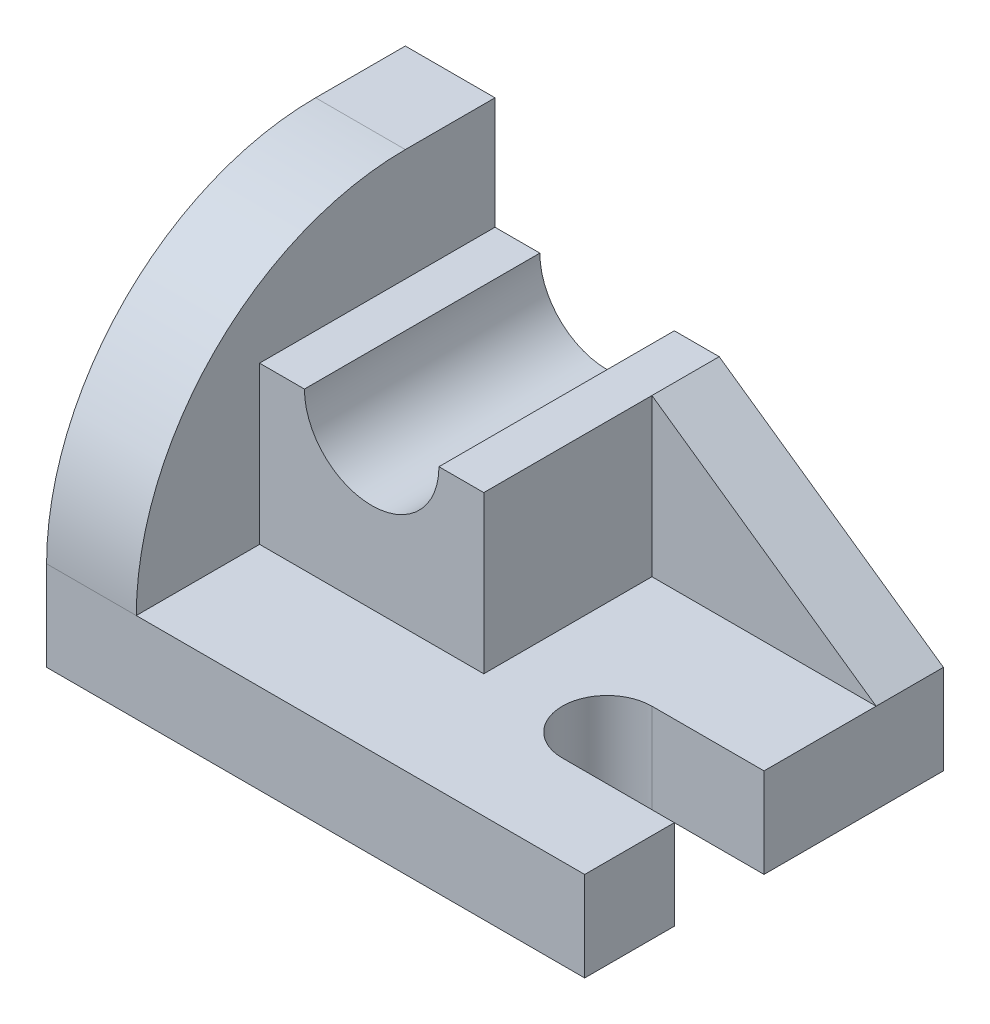
ISO-10303-21;
HEADER;
FILE_DESCRIPTION(('STEP AP214'),'2;1');
FILE_NAME('part.step','',(''),(''),'','','');
FILE_SCHEMA(('AUTOMOTIVE_DESIGN { 1 0 10303 214 1 1 1 1 }'));
ENDSEC;
DATA;
#1=APPLICATION_CONTEXT('core data for automotive mechanical design processes');
#2=APPLICATION_PROTOCOL_DEFINITION('international standard','automotive_design',2000,#1);
#3=PRODUCT_CONTEXT('',#1,'mechanical');
#4=PRODUCT('Part','Part','',(#3));
#5=PRODUCT_RELATED_PRODUCT_CATEGORY('part','',(#4));
#6=PRODUCT_DEFINITION_FORMATION('','',#4);
#7=PRODUCT_DEFINITION_CONTEXT('part definition',#1,'design');
#8=PRODUCT_DEFINITION('design','',#6,#7);
#9=PRODUCT_DEFINITION_SHAPE('','',#8);
#10=(LENGTH_UNIT() NAMED_UNIT(*) SI_UNIT(.MILLI.,.METRE.));
#11=(NAMED_UNIT(*) PLANE_ANGLE_UNIT() SI_UNIT($,.RADIAN.));
#12=(NAMED_UNIT(*) SI_UNIT($,.STERADIAN.) SOLID_ANGLE_UNIT());
#13=UNCERTAINTY_MEASURE_WITH_UNIT(LENGTH_MEASURE(1.E-05),#10,'distance_accuracy_value','');
#14=(GEOMETRIC_REPRESENTATION_CONTEXT(3) GLOBAL_UNCERTAINTY_ASSIGNED_CONTEXT((#13)) GLOBAL_UNIT_ASSIGNED_CONTEXT((#10,
#11,#12)) REPRESENTATION_CONTEXT('',''));
#15=CARTESIAN_POINT('',(0.,0.,0.));
#16=DIRECTION('',(0.,0.,1.));
#17=DIRECTION('',(1.,0.,0.));
#18=AXIS2_PLACEMENT_3D('',#15,#16,#17);
#19=CARTESIAN_POINT('',(0.,44.,0.));
#20=DIRECTION('',(0.,1.,0.));
#21=DIRECTION('',(0.,0.,1.));
#22=AXIS2_PLACEMENT_3D('',#19,#20,#21);
#23=PLANE('',#22);
#24=DIRECTION('',(0.,0.,1.));
#25=VECTOR('',#24,1.);
#26=CARTESIAN_POINT('',(24.,44.,-64.));
#27=LINE('',#26,#25);
#28=CARTESIAN_POINT('',(24.,44.,-64.));
#29=VERTEX_POINT('',#28);
#30=CARTESIAN_POINT('',(24.,44.,-22.));
#31=VERTEX_POINT('',#30);
#32=EDGE_CURVE('E11',#29,#31,#27,.T.);
#33=ORIENTED_EDGE('',*,*,#32,.F.);
#34=DIRECTION('',(-1.,0.,0.));
#35=VECTOR('',#34,1.);
#36=CARTESIAN_POINT('',(16.,44.,-64.));
#37=LINE('',#36,#35);
#38=CARTESIAN_POINT('',(16.,44.,-64.));
#39=VERTEX_POINT('',#38);
#40=EDGE_CURVE('E188',#29,#39,#37,.T.);
#41=ORIENTED_EDGE('',*,*,#40,.T.);
#42=DIRECTION('',(0.,0.,1.));
#43=VECTOR('',#42,1.);
#44=CARTESIAN_POINT('',(16.,44.,-64.));
#45=LINE('',#44,#43);
#46=CARTESIAN_POINT('',(16.,44.,-22.));
#47=VERTEX_POINT('',#46);
#48=EDGE_CURVE('E202',#39,#47,#45,.T.);
#49=ORIENTED_EDGE('',*,*,#48,.T.);
#50=DIRECTION('',(1.,0.,0.));
#51=VECTOR('',#50,1.);
#52=CARTESIAN_POINT('',(16.,44.,-22.));
#53=LINE('',#52,#51);
#54=EDGE_CURVE('E189',#47,#31,#53,.T.);
#55=ORIENTED_EDGE('',*,*,#54,.T.);
#56=EDGE_LOOP('',(#33,#41,#49,#55));
#57=FACE_BOUND('',#56,.T.);
#58=ADVANCED_FACE('F43',(#57),#23,.T.);
#59=CARTESIAN_POINT('',(0.,16.,0.));
#60=DIRECTION('',(0.,-1.,0.));
#61=DIRECTION('',(0.,0.,-1.));
#62=AXIS2_PLACEMENT_3D('',#59,#60,#61);
#63=PLANE('',#62);
#64=DIRECTION('',(0.,0.,-1.));
#65=VECTOR('',#64,1.);
#66=CARTESIAN_POINT('',(96.,16.,0.));
#67=LINE('',#66,#65);
#68=CARTESIAN_POINT('',(96.,16.,-32.));
#69=VERTEX_POINT('',#68);
#70=CARTESIAN_POINT('',(96.,16.,-52.));
#71=VERTEX_POINT('',#70);
#72=EDGE_CURVE('E259',#69,#71,#67,.T.);
#73=ORIENTED_EDGE('',*,*,#72,.T.);
#74=DIRECTION('',(-1.,0.,0.));
#75=VECTOR('',#74,1.);
#76=CARTESIAN_POINT('',(56.,16.,-52.));
#77=LINE('',#76,#75);
#78=CARTESIAN_POINT('',(56.,16.,-52.));
#79=VERTEX_POINT('',#78);
#80=EDGE_CURVE('E170',#71,#79,#77,.T.);
#81=ORIENTED_EDGE('',*,*,#80,.T.);
#82=DIRECTION('',(0.,0.,-1.));
#83=VECTOR('',#82,1.);
#84=CARTESIAN_POINT('',(56.,16.,-64.));
#85=LINE('',#84,#83);
#86=CARTESIAN_POINT('',(56.,16.,-22.));
#87=VERTEX_POINT('',#86);
#88=EDGE_CURVE('E65',#87,#79,#85,.T.);
#89=ORIENTED_EDGE('',*,*,#88,.F.);
#90=DIRECTION('',(1.,0.,0.));
#91=VECTOR('',#90,1.);
#92=CARTESIAN_POINT('',(16.,16.,-22.));
#93=LINE('',#92,#91);
#94=CARTESIAN_POINT('',(16.,16.,-22.));
#95=VERTEX_POINT('',#94);
#96=EDGE_CURVE('E198',#95,#87,#93,.T.);
#97=ORIENTED_EDGE('',*,*,#96,.F.);
#98=DIRECTION('',(0.,0.,1.));
#99=VECTOR('',#98,1.);
#100=CARTESIAN_POINT('',(16.,16.,0.));
#101=LINE('',#100,#99);
#102=CARTESIAN_POINT('',(16.,16.,0.));
#103=VERTEX_POINT('',#102);
#104=EDGE_CURVE('E226',#95,#103,#101,.T.);
#105=ORIENTED_EDGE('',*,*,#104,.T.);
#106=DIRECTION('',(1.,0.,0.));
#107=VECTOR('',#106,1.);
#108=CARTESIAN_POINT('',(0.,16.,0.));
#109=LINE('',#108,#107);
#110=CARTESIAN_POINT('',(96.,16.,0.));
#111=VERTEX_POINT('',#110);
#112=EDGE_CURVE('E260',#103,#111,#109,.T.);
#113=ORIENTED_EDGE('',*,*,#112,.T.);
#114=CARTESIAN_POINT('',(96.,16.,-16.));
#115=VERTEX_POINT('',#114);
#116=EDGE_CURVE('E261',#111,#115,#67,.T.);
#117=ORIENTED_EDGE('',*,*,#116,.T.);
#118=DIRECTION('',(1.,0.,0.));
#119=VECTOR('',#118,1.);
#120=CARTESIAN_POINT('',(96.,16.,-16.));
#121=LINE('',#120,#119);
#122=CARTESIAN_POINT('',(76.,16.,-16.));
#123=VERTEX_POINT('',#122);
#124=EDGE_CURVE('E234',#123,#115,#121,.T.);
#125=ORIENTED_EDGE('',*,*,#124,.F.);
#126=CARTESIAN_POINT('',(76.,16.,-24.));
#127=DIRECTION('',(0.,1.,0.));
#128=DIRECTION('',(0.,0.,1.));
#129=AXIS2_PLACEMENT_3D('',#126,#127,#128);
#130=CIRCLE('',#129,7.99999999999999);
#131=CARTESIAN_POINT('',(76.,16.,-32.));
#132=VERTEX_POINT('',#131);
#133=EDGE_CURVE('E243',#132,#123,#130,.T.);
#134=ORIENTED_EDGE('',*,*,#133,.F.);
#135=DIRECTION('',(-1.,0.,0.));
#136=VECTOR('',#135,1.);
#137=CARTESIAN_POINT('',(96.,16.,-32.));
#138=LINE('',#137,#136);
#139=EDGE_CURVE('E229',#69,#132,#138,.T.);
#140=ORIENTED_EDGE('',*,*,#139,.F.);
#141=EDGE_LOOP('',(#73,#81,#89,#97,#105,#113,#117,#125,#134,#140));
#142=FACE_BOUND('',#141,.T.);
#143=ADVANCED_FACE('F317',(#142),#63,.F.);
#144=CARTESIAN_POINT('',(16.,16.,-48.));
#145=DIRECTION('',(1.,0.,0.));
#146=DIRECTION('',(0.,0.,-1.));
#147=AXIS2_PLACEMENT_3D('',#144,#145,#146);
#148=PLANE('',#147);
#149=ORIENTED_EDGE('',*,*,#104,.F.);
#150=DIRECTION('',(0.,-1.,0.));
#151=VECTOR('',#150,1.);
#152=CARTESIAN_POINT('',(16.,44.,-22.));
#153=LINE('',#152,#151);
#154=EDGE_CURVE('E204',#47,#95,#153,.T.);
#155=ORIENTED_EDGE('',*,*,#154,.F.);
#156=ORIENTED_EDGE('',*,*,#48,.F.);
#157=DIRECTION('',(0.,-1.,0.));
#158=VECTOR('',#157,1.);
#159=CARTESIAN_POINT('',(16.,0.,-64.));
#160=LINE('',#159,#158);
#161=CARTESIAN_POINT('',(16.,64.,-64.));
#162=VERTEX_POINT('',#161);
#163=EDGE_CURVE('E208',#162,#39,#160,.T.);
#164=ORIENTED_EDGE('',*,*,#163,.F.);
#165=DIRECTION('',(0.,0.,-1.));
#166=VECTOR('',#165,1.);
#167=CARTESIAN_POINT('',(16.,64.,-64.));
#168=LINE('',#167,#166);
#169=CARTESIAN_POINT('',(16.,64.,-48.0000000000003));
#170=VERTEX_POINT('',#169);
#171=EDGE_CURVE('E215',#170,#162,#168,.T.);
#172=ORIENTED_EDGE('',*,*,#171,.F.);
#173=CARTESIAN_POINT('',(16.,16.,-48.));
#174=DIRECTION('',(-1.,0.,0.));
#175=DIRECTION('',(0.,0.,-1.));
#176=AXIS2_PLACEMENT_3D('',#173,#174,#175);
#177=CIRCLE('',#176,48.);
#178=EDGE_CURVE('E211',#103,#170,#177,.T.);
#179=ORIENTED_EDGE('',*,*,#178,.F.);
#180=EDGE_LOOP('',(#149,#155,#156,#164,#172,#179));
#181=FACE_BOUND('',#180,.T.);
#182=ADVANCED_FACE('F301',(#181),#148,.T.);
#183=CARTESIAN_POINT('',(96.,16.,0.));
#184=DIRECTION('',(-1.,0.,0.));
#185=DIRECTION('',(0.,0.,1.));
#186=AXIS2_PLACEMENT_3D('',#183,#184,#185);
#187=PLANE('',#186);
#188=DIRECTION('',(0.,0.,-1.));
#189=VECTOR('',#188,1.);
#190=CARTESIAN_POINT('',(96.,0.,0.));
#191=LINE('',#190,#189);
#192=CARTESIAN_POINT('',(96.,0.,0.));
#193=VERTEX_POINT('',#192);
#194=CARTESIAN_POINT('',(96.,0.,-16.));
#195=VERTEX_POINT('',#194);
#196=EDGE_CURVE('E270',#193,#195,#191,.T.);
#197=ORIENTED_EDGE('',*,*,#196,.T.);
#198=DIRECTION('',(0.,1.,0.));
#199=VECTOR('',#198,1.);
#200=CARTESIAN_POINT('',(96.,0.,-16.));
#201=LINE('',#200,#199);
#202=EDGE_CURVE('E247',#195,#115,#201,.T.);
#203=ORIENTED_EDGE('',*,*,#202,.T.);
#204=ORIENTED_EDGE('',*,*,#116,.F.);
#205=DIRECTION('',(0.,-1.,0.));
#206=VECTOR('',#205,1.);
#207=CARTESIAN_POINT('',(96.,16.,0.));
#208=LINE('',#207,#206);
#209=EDGE_CURVE('E280',#111,#193,#208,.T.);
#210=ORIENTED_EDGE('',*,*,#209,.T.);
#211=EDGE_LOOP('',(#197,#203,#204,#210));
#212=FACE_BOUND('',#211,.T.);
#213=ADVANCED_FACE('F327',(#212),#187,.F.);
#214=CARTESIAN_POINT('',(0.,16.,0.));
#215=DIRECTION('',(1.,0.,0.));
#216=DIRECTION('',(0.,0.,-1.));
#217=AXIS2_PLACEMENT_3D('',#214,#215,#216);
#218=PLANE('',#217);
#219=DIRECTION('',(0.,0.,1.));
#220=VECTOR('',#219,1.);
#221=CARTESIAN_POINT('',(0.,0.,0.));
#222=LINE('',#221,#220);
#223=CARTESIAN_POINT('',(0.,0.,-64.));
#224=VERTEX_POINT('',#223);
#225=CARTESIAN_POINT('',(0.,0.,0.));
#226=VERTEX_POINT('',#225);
#227=EDGE_CURVE('E250',#224,#226,#222,.T.);
#228=ORIENTED_EDGE('',*,*,#227,.T.);
#229=DIRECTION('',(0.,-1.,0.));
#230=VECTOR('',#229,1.);
#231=CARTESIAN_POINT('',(0.,16.,0.));
#232=LINE('',#231,#230);
#233=CARTESIAN_POINT('',(0.,15.9999999999997,0.));
#234=VERTEX_POINT('',#233);
#235=EDGE_CURVE('E283',#234,#226,#232,.T.);
#236=ORIENTED_EDGE('',*,*,#235,.F.);
#237=CARTESIAN_POINT('',(0.,16.,-48.));
#238=DIRECTION('',(-1.,0.,0.));
#239=DIRECTION('',(0.,0.,-1.));
#240=AXIS2_PLACEMENT_3D('',#237,#238,#239);
#241=CIRCLE('',#240,48.);
#242=CARTESIAN_POINT('',(0.,64.,-48.0000000000003));
#243=VERTEX_POINT('',#242);
#244=EDGE_CURVE('E207',#234,#243,#241,.T.);
#245=ORIENTED_EDGE('',*,*,#244,.T.);
#246=DIRECTION('',(0.,0.,-1.));
#247=VECTOR('',#246,1.);
#248=CARTESIAN_POINT('',(0.,64.,-64.));
#249=LINE('',#248,#247);
#250=CARTESIAN_POINT('',(0.,64.,-64.));
#251=VERTEX_POINT('',#250);
#252=EDGE_CURVE('E212',#243,#251,#249,.T.);
#253=ORIENTED_EDGE('',*,*,#252,.T.);
#254=DIRECTION('',(0.,-1.,0.));
#255=VECTOR('',#254,1.);
#256=CARTESIAN_POINT('',(0.,16.,-64.));
#257=LINE('',#256,#255);
#258=EDGE_CURVE('E264',#251,#224,#257,.T.);
#259=ORIENTED_EDGE('',*,*,#258,.T.);
#260=EDGE_LOOP('',(#228,#236,#245,#253,#259));
#261=FACE_BOUND('',#260,.T.);
#262=ADVANCED_FACE('F45',(#261),#218,.F.);
#263=CARTESIAN_POINT('',(0.,16.,0.));
#264=DIRECTION('',(0.,0.,-1.));
#265=DIRECTION('',(-1.,0.,0.));
#266=AXIS2_PLACEMENT_3D('',#263,#264,#265);
#267=PLANE('',#266);
#268=ORIENTED_EDGE('',*,*,#112,.F.);
#269=EDGE_CURVE('E256',#234,#103,#109,.T.);
#270=ORIENTED_EDGE('',*,*,#269,.F.);
#271=ORIENTED_EDGE('',*,*,#235,.T.);
#272=DIRECTION('',(1.,0.,0.));
#273=VECTOR('',#272,1.);
#274=CARTESIAN_POINT('',(0.,0.,0.));
#275=LINE('',#274,#273);
#276=EDGE_CURVE('E267',#226,#193,#275,.T.);
#277=ORIENTED_EDGE('',*,*,#276,.T.);
#278=ORIENTED_EDGE('',*,*,#209,.F.);
#279=EDGE_LOOP('',(#268,#270,#271,#277,#278));
#280=FACE_BOUND('',#279,.T.);
#281=ADVANCED_FACE('F343',(#280),#267,.F.);
#282=ORIENTED_EDGE('',*,*,#72,.F.);
#283=DIRECTION('',(0.,1.,0.));
#284=VECTOR('',#283,1.);
#285=CARTESIAN_POINT('',(96.,0.,-32.));
#286=LINE('',#285,#284);
#287=CARTESIAN_POINT('',(96.,0.,-32.));
#288=VERTEX_POINT('',#287);
#289=EDGE_CURVE('E240',#288,#69,#286,.T.);
#290=ORIENTED_EDGE('',*,*,#289,.F.);
#291=CARTESIAN_POINT('',(96.,0.,-64.));
#292=VERTEX_POINT('',#291);
#293=EDGE_CURVE('E269',#288,#292,#191,.T.);
#294=ORIENTED_EDGE('',*,*,#293,.T.);
#295=DIRECTION('',(0.,-1.,0.));
#296=VECTOR('',#295,1.);
#297=CARTESIAN_POINT('',(96.,16.,-64.));
#298=LINE('',#297,#296);
#299=CARTESIAN_POINT('',(96.,16.,-64.));
#300=VERTEX_POINT('',#299);
#301=EDGE_CURVE('E277',#300,#292,#298,.T.);
#302=ORIENTED_EDGE('',*,*,#301,.F.);
#303=DIRECTION('',(0.,0.,-1.));
#304=VECTOR('',#303,1.);
#305=CARTESIAN_POINT('',(96.,16.,-52.));
#306=LINE('',#305,#304);
#307=EDGE_CURVE('E169',#71,#300,#306,.T.);
#308=ORIENTED_EDGE('',*,*,#307,.F.);
#309=EDGE_LOOP('',(#282,#290,#294,#302,#308));
#310=FACE_BOUND('',#309,.T.);
#311=ADVANCED_FACE('F342',(#310),#187,.F.);
#312=CARTESIAN_POINT('',(0.,16.,-64.));
#313=DIRECTION('',(0.,0.,1.));
#314=DIRECTION('',(1.,0.,0.));
#315=AXIS2_PLACEMENT_3D('',#312,#313,#314);
#316=PLANE('',#315);
#317=ORIENTED_EDGE('',*,*,#40,.F.);
#318=CARTESIAN_POINT('',(36.,44.,-64.));
#319=DIRECTION('',(0.,0.,1.));
#320=DIRECTION('',(1.,0.,0.));
#321=AXIS2_PLACEMENT_3D('',#318,#319,#320);
#322=CIRCLE('',#321,12.);
#323=CARTESIAN_POINT('',(48.,44.,-64.));
#324=VERTEX_POINT('',#323);
#325=EDGE_CURVE('E200',#29,#324,#322,.T.);
#326=ORIENTED_EDGE('',*,*,#325,.T.);
#327=CARTESIAN_POINT('',(56.,44.,-64.));
#328=VERTEX_POINT('',#327);
#329=EDGE_CURVE('E191',#328,#324,#37,.T.);
#330=ORIENTED_EDGE('',*,*,#329,.F.);
#331=DIRECTION('',(0.81923192051904,-0.573462344363329,0.));
#332=VECTOR('',#331,1.);
#333=CARTESIAN_POINT('',(56.,44.,-64.));
#334=LINE('',#333,#332);
#335=EDGE_CURVE('E164',#328,#300,#334,.T.);
#336=ORIENTED_EDGE('',*,*,#335,.T.);
#337=ORIENTED_EDGE('',*,*,#301,.T.);
#338=DIRECTION('',(-1.,0.,0.));
#339=VECTOR('',#338,1.);
#340=CARTESIAN_POINT('',(0.,0.,-64.));
#341=LINE('',#340,#339);
#342=EDGE_CURVE('E273',#292,#224,#341,.T.);
#343=ORIENTED_EDGE('',*,*,#342,.T.);
#344=ORIENTED_EDGE('',*,*,#258,.F.);
#345=DIRECTION('',(-1.,0.,0.));
#346=VECTOR('',#345,1.);
#347=CARTESIAN_POINT('',(16.,64.,-64.));
#348=LINE('',#347,#346);
#349=EDGE_CURVE('E223',#162,#251,#348,.T.);
#350=ORIENTED_EDGE('',*,*,#349,.F.);
#351=ORIENTED_EDGE('',*,*,#163,.T.);
#352=EDGE_LOOP('',(#317,#326,#330,#336,#337,#343,#344,#350,#351));
#353=FACE_BOUND('',#352,.T.);
#354=ADVANCED_FACE('F290',(#353),#316,.F.);
#355=CARTESIAN_POINT('',(0.,0.,0.));
#356=DIRECTION('',(0.,-1.,0.));
#357=DIRECTION('',(0.,0.,-1.));
#358=AXIS2_PLACEMENT_3D('',#355,#356,#357);
#359=PLANE('',#358);
#360=ORIENTED_EDGE('',*,*,#196,.F.);
#361=ORIENTED_EDGE('',*,*,#276,.F.);
#362=ORIENTED_EDGE('',*,*,#227,.F.);
#363=ORIENTED_EDGE('',*,*,#342,.F.);
#364=ORIENTED_EDGE('',*,*,#293,.F.);
#365=DIRECTION('',(-1.,0.,0.));
#366=VECTOR('',#365,1.);
#367=CARTESIAN_POINT('',(96.,0.,-32.));
#368=LINE('',#367,#366);
#369=CARTESIAN_POINT('',(76.,0.,-32.));
#370=VERTEX_POINT('',#369);
#371=EDGE_CURVE('E230',#288,#370,#368,.T.);
#372=ORIENTED_EDGE('',*,*,#371,.T.);
#373=CARTESIAN_POINT('',(76.,0.,-24.));
#374=DIRECTION('',(0.,1.,0.));
#375=DIRECTION('',(0.,0.,1.));
#376=AXIS2_PLACEMENT_3D('',#373,#374,#375);
#377=CIRCLE('',#376,7.99999999999999);
#378=CARTESIAN_POINT('',(76.,0.,-16.));
#379=VERTEX_POINT('',#378);
#380=EDGE_CURVE('E233',#370,#379,#377,.T.);
#381=ORIENTED_EDGE('',*,*,#380,.T.);
#382=DIRECTION('',(1.,0.,0.));
#383=VECTOR('',#382,1.);
#384=CARTESIAN_POINT('',(96.,0.,-16.));
#385=LINE('',#384,#383);
#386=EDGE_CURVE('E237',#379,#195,#385,.T.);
#387=ORIENTED_EDGE('',*,*,#386,.T.);
#388=EDGE_LOOP('',(#360,#361,#362,#363,#364,#372,#381,#387));
#389=FACE_BOUND('',#388,.T.);
#390=ADVANCED_FACE('F335',(#389),#359,.T.);
#391=CARTESIAN_POINT('',(96.,0.,-16.));
#392=DIRECTION('',(0.,0.,1.));
#393=DIRECTION('',(1.,0.,0.));
#394=AXIS2_PLACEMENT_3D('',#391,#392,#393);
#395=PLANE('',#394);
#396=ORIENTED_EDGE('',*,*,#124,.T.);
#397=ORIENTED_EDGE('',*,*,#202,.F.);
#398=ORIENTED_EDGE('',*,*,#386,.F.);
#399=DIRECTION('',(0.,1.,0.));
#400=VECTOR('',#399,1.);
#401=CARTESIAN_POINT('',(76.,0.,-16.));
#402=LINE('',#401,#400);
#403=EDGE_CURVE('E251',#379,#123,#402,.T.);
#404=ORIENTED_EDGE('',*,*,#403,.T.);
#405=EDGE_LOOP('',(#396,#397,#398,#404));
#406=FACE_BOUND('',#405,.T.);
#407=ADVANCED_FACE('F338',(#406),#395,.F.);
#408=CARTESIAN_POINT('',(76.,0.,-24.));
#409=DIRECTION('',(0.,1.,0.));
#410=DIRECTION('',(0.,0.,1.));
#411=AXIS2_PLACEMENT_3D('',#408,#409,#410);
#412=CYLINDRICAL_SURFACE('',#411,7.99999999999999);
#413=ORIENTED_EDGE('',*,*,#133,.T.);
#414=ORIENTED_EDGE('',*,*,#403,.F.);
#415=ORIENTED_EDGE('',*,*,#380,.F.);
#416=DIRECTION('',(0.,1.,0.));
#417=VECTOR('',#416,1.);
#418=CARTESIAN_POINT('',(76.,0.,-32.));
#419=LINE('',#418,#417);
#420=EDGE_CURVE('E253',#370,#132,#419,.T.);
#421=ORIENTED_EDGE('',*,*,#420,.T.);
#422=EDGE_LOOP('',(#413,#414,#415,#421));
#423=FACE_BOUND('',#422,.T.);
#424=ADVANCED_FACE('F361',(#423),#412,.F.);
#425=CARTESIAN_POINT('',(96.,0.,-32.));
#426=DIRECTION('',(0.,0.,-1.));
#427=DIRECTION('',(-1.,0.,0.));
#428=AXIS2_PLACEMENT_3D('',#425,#426,#427);
#429=PLANE('',#428);
#430=ORIENTED_EDGE('',*,*,#139,.T.);
#431=ORIENTED_EDGE('',*,*,#420,.F.);
#432=ORIENTED_EDGE('',*,*,#371,.F.);
#433=ORIENTED_EDGE('',*,*,#289,.T.);
#434=EDGE_LOOP('',(#430,#431,#432,#433));
#435=FACE_BOUND('',#434,.T.);
#436=ADVANCED_FACE('F333',(#435),#429,.F.);
#437=CARTESIAN_POINT('',(16.,64.,-64.));
#438=DIRECTION('',(0.,1.,0.));
#439=DIRECTION('',(0.,0.,1.));
#440=AXIS2_PLACEMENT_3D('',#437,#438,#439);
#441=PLANE('',#440);
#442=ORIENTED_EDGE('',*,*,#252,.F.);
#443=DIRECTION('',(-1.,0.,0.));
#444=VECTOR('',#443,1.);
#445=CARTESIAN_POINT('',(16.,64.,-48.0000000000003));
#446=LINE('',#445,#444);
#447=EDGE_CURVE('E218',#170,#243,#446,.T.);
#448=ORIENTED_EDGE('',*,*,#447,.F.);
#449=ORIENTED_EDGE('',*,*,#171,.T.);
#450=ORIENTED_EDGE('',*,*,#349,.T.);
#451=EDGE_LOOP('',(#442,#448,#449,#450));
#452=FACE_BOUND('',#451,.T.);
#453=ADVANCED_FACE('F305',(#452),#441,.T.);
#454=CARTESIAN_POINT('',(16.,16.,-48.));
#455=DIRECTION('',(-1.,0.,0.));
#456=DIRECTION('',(0.,0.,1.));
#457=AXIS2_PLACEMENT_3D('',#454,#455,#456);
#458=CYLINDRICAL_SURFACE('',#457,48.);
#459=ORIENTED_EDGE('',*,*,#244,.F.);
#460=ORIENTED_EDGE('',*,*,#269,.T.);
#461=ORIENTED_EDGE('',*,*,#178,.T.);
#462=ORIENTED_EDGE('',*,*,#447,.T.);
#463=EDGE_LOOP('',(#459,#460,#461,#462));
#464=FACE_BOUND('',#463,.T.);
#465=ADVANCED_FACE('F311',(#464),#458,.T.);
#466=CARTESIAN_POINT('',(16.,44.,-22.));
#467=DIRECTION('',(0.,0.,-1.));
#468=DIRECTION('',(-1.,0.,0.));
#469=AXIS2_PLACEMENT_3D('',#466,#467,#468);
#470=PLANE('',#469);
#471=CARTESIAN_POINT('',(48.,44.,-22.));
#472=VERTEX_POINT('',#471);
#473=CARTESIAN_POINT('',(56.,44.,-22.));
#474=VERTEX_POINT('',#473);
#475=EDGE_CURVE('E186',#472,#474,#53,.T.);
#476=ORIENTED_EDGE('',*,*,#475,.F.);
#477=CARTESIAN_POINT('',(36.,44.,-22.));
#478=DIRECTION('',(0.,0.,1.));
#479=DIRECTION('',(1.,0.,0.));
#480=AXIS2_PLACEMENT_3D('',#477,#478,#479);
#481=CIRCLE('',#480,12.);
#482=EDGE_CURVE('E57',#31,#472,#481,.T.);
#483=ORIENTED_EDGE('',*,*,#482,.F.);
#484=ORIENTED_EDGE('',*,*,#54,.F.);
#485=ORIENTED_EDGE('',*,*,#154,.T.);
#486=ORIENTED_EDGE('',*,*,#96,.T.);
#487=DIRECTION('',(0.,-1.,0.));
#488=VECTOR('',#487,1.);
#489=CARTESIAN_POINT('',(56.,44.,-22.));
#490=LINE('',#489,#488);
#491=EDGE_CURVE('E197',#474,#87,#490,.T.);
#492=ORIENTED_EDGE('',*,*,#491,.F.);
#493=EDGE_LOOP('',(#476,#483,#484,#485,#486,#492));
#494=FACE_BOUND('',#493,.T.);
#495=ADVANCED_FACE('F315',(#494),#470,.F.);
#496=CARTESIAN_POINT('',(56.,44.,-64.));
#497=DIRECTION('',(-1.,0.,0.));
#498=DIRECTION('',(0.,0.,1.));
#499=AXIS2_PLACEMENT_3D('',#496,#497,#498);
#500=PLANE('',#499);
#501=ORIENTED_EDGE('',*,*,#88,.T.);
#502=DIRECTION('',(0.,1.,0.));
#503=VECTOR('',#502,1.);
#504=CARTESIAN_POINT('',(56.,44.,-52.));
#505=LINE('',#504,#503);
#506=CARTESIAN_POINT('',(56.,44.,-52.));
#507=VERTEX_POINT('',#506);
#508=EDGE_CURVE('E175',#79,#507,#505,.T.);
#509=ORIENTED_EDGE('',*,*,#508,.T.);
#510=DIRECTION('',(0.,0.,-1.));
#511=VECTOR('',#510,1.);
#512=CARTESIAN_POINT('',(56.,44.,-64.));
#513=LINE('',#512,#511);
#514=EDGE_CURVE('E182',#474,#507,#513,.T.);
#515=ORIENTED_EDGE('',*,*,#514,.F.);
#516=ORIENTED_EDGE('',*,*,#491,.T.);
#517=EDGE_LOOP('',(#501,#509,#515,#516));
#518=FACE_BOUND('',#517,.T.);
#519=ADVANCED_FACE('F180',(#518),#500,.F.);
#520=DIRECTION('',(0.,0.,1.));
#521=VECTOR('',#520,1.);
#522=CARTESIAN_POINT('',(48.,44.,-64.));
#523=LINE('',#522,#521);
#524=EDGE_CURVE('E51',#472,#324,#523,.F.);
#525=ORIENTED_EDGE('',*,*,#524,.F.);
#526=ORIENTED_EDGE('',*,*,#475,.T.);
#527=ORIENTED_EDGE('',*,*,#514,.T.);
#528=DIRECTION('',(0.,0.,-1.));
#529=VECTOR('',#528,1.);
#530=CARTESIAN_POINT('',(56.,44.,-52.));
#531=LINE('',#530,#529);
#532=EDGE_CURVE('E158',#507,#328,#531,.T.);
#533=ORIENTED_EDGE('',*,*,#532,.T.);
#534=ORIENTED_EDGE('',*,*,#329,.T.);
#535=EDGE_LOOP('',(#525,#526,#527,#533,#534));
#536=FACE_BOUND('',#535,.T.);
#537=ADVANCED_FACE('F184',(#536),#23,.T.);
#538=CARTESIAN_POINT('',(36.,44.,-64.));
#539=DIRECTION('',(0.,0.,1.));
#540=DIRECTION('',(1.,0.,0.));
#541=AXIS2_PLACEMENT_3D('',#538,#539,#540);
#542=CYLINDRICAL_SURFACE('',#541,12.);
#543=ORIENTED_EDGE('',*,*,#32,.T.);
#544=ORIENTED_EDGE('',*,*,#482,.T.);
#545=ORIENTED_EDGE('',*,*,#524,.T.);
#546=ORIENTED_EDGE('',*,*,#325,.F.);
#547=EDGE_LOOP('',(#543,#544,#545,#546));
#548=FACE_BOUND('',#547,.T.);
#549=ADVANCED_FACE('F286',(#548),#542,.F.);
#550=CARTESIAN_POINT('',(56.,44.,-52.));
#551=DIRECTION('',(0.573462344363329,0.81923192051904,0.));
#552=DIRECTION('',(-0.81923192051904,0.573462344363329,0.));
#553=AXIS2_PLACEMENT_3D('',#550,#551,#552);
#554=PLANE('',#553);
#555=ORIENTED_EDGE('',*,*,#335,.F.);
#556=ORIENTED_EDGE('',*,*,#532,.F.);
#557=DIRECTION('',(0.81923192051904,-0.573462344363329,0.));
#558=VECTOR('',#557,1.);
#559=CARTESIAN_POINT('',(56.,44.,-52.));
#560=LINE('',#559,#558);
#561=EDGE_CURVE('E161',#507,#71,#560,.T.);
#562=ORIENTED_EDGE('',*,*,#561,.T.);
#563=ORIENTED_EDGE('',*,*,#307,.T.);
#564=EDGE_LOOP('',(#555,#556,#562,#563));
#565=FACE_BOUND('',#564,.T.);
#566=ADVANCED_FACE('F160',(#565),#554,.T.);
#567=CARTESIAN_POINT('',(0.,0.,-52.));
#568=DIRECTION('',(0.,0.,1.));
#569=DIRECTION('',(1.,0.,0.));
#570=AXIS2_PLACEMENT_3D('',#567,#568,#569);
#571=PLANE('',#570);
#572=ORIENTED_EDGE('',*,*,#508,.F.);
#573=ORIENTED_EDGE('',*,*,#80,.F.);
#574=ORIENTED_EDGE('',*,*,#561,.F.);
#575=EDGE_LOOP('',(#572,#573,#574));
#576=FACE_BOUND('',#575,.T.);
#577=ADVANCED_FACE('F174',(#576),#571,.T.);
#578=CLOSED_SHELL('',(#58,#143,#182,#213,#262,#281,#311,#354,#390,#407,#424,#436,#453,#465,#495,
#519,#537,#549,#566,#577));
#579=MANIFOLD_SOLID_BREP('B2',#578);
#580=ADVANCED_BREP_SHAPE_REPRESENTATION('',(#18,#579),#14);
#581=SHAPE_DEFINITION_REPRESENTATION(#9,#580);
ENDSEC;
END-ISO-10303-21;
